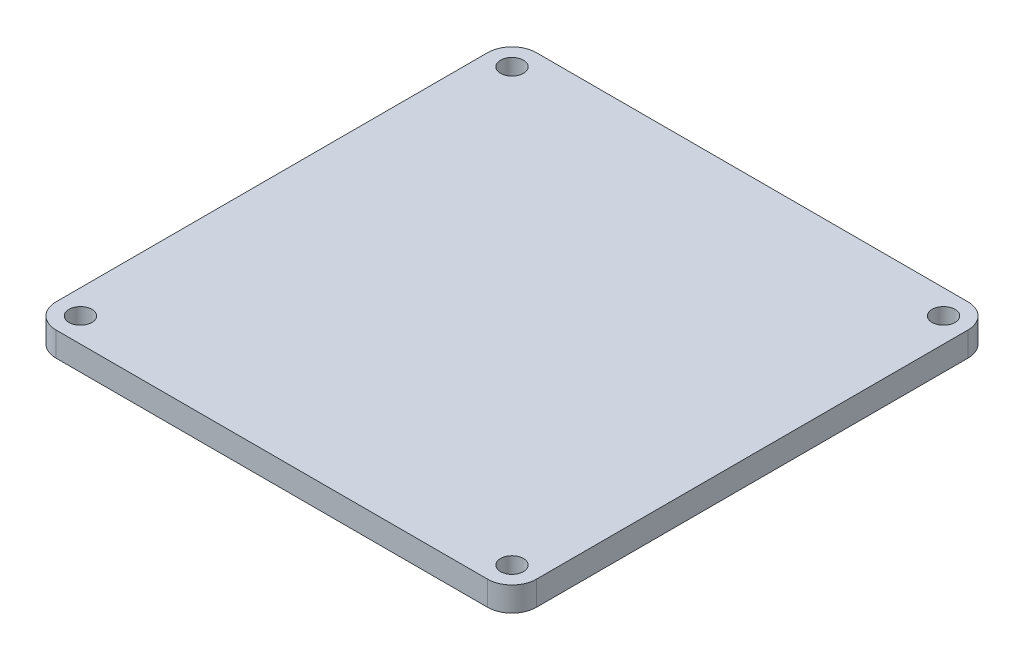
ISO-10303-21;
HEADER;
FILE_DESCRIPTION(('STEP AP214'),'2;1');
FILE_NAME('part.step','',(''),(''),'','','');
FILE_SCHEMA(('AUTOMOTIVE_DESIGN { 1 0 10303 214 1 1 1 1 }'));
ENDSEC;
DATA;
#1=APPLICATION_CONTEXT('core data for automotive mechanical design processes');
#2=APPLICATION_PROTOCOL_DEFINITION('international standard','automotive_design',2000,#1);
#3=PRODUCT_CONTEXT('',#1,'mechanical');
#4=PRODUCT('Part','Part','',(#3));
#5=PRODUCT_RELATED_PRODUCT_CATEGORY('part','',(#4));
#6=PRODUCT_DEFINITION_FORMATION('','',#4);
#7=PRODUCT_DEFINITION_CONTEXT('part definition',#1,'design');
#8=PRODUCT_DEFINITION('design','',#6,#7);
#9=PRODUCT_DEFINITION_SHAPE('','',#8);
#10=(LENGTH_UNIT() NAMED_UNIT(*) SI_UNIT(.MILLI.,.METRE.));
#11=(NAMED_UNIT(*) PLANE_ANGLE_UNIT() SI_UNIT($,.RADIAN.));
#12=(NAMED_UNIT(*) SI_UNIT($,.STERADIAN.) SOLID_ANGLE_UNIT());
#13=UNCERTAINTY_MEASURE_WITH_UNIT(LENGTH_MEASURE(1.E-05),#10,'distance_accuracy_value','');
#14=(GEOMETRIC_REPRESENTATION_CONTEXT(3) GLOBAL_UNCERTAINTY_ASSIGNED_CONTEXT((#13)) GLOBAL_UNIT_ASSIGNED_CONTEXT((#10,
#11,#12)) REPRESENTATION_CONTEXT('',''));
#15=CARTESIAN_POINT('',(0.,0.,0.));
#16=DIRECTION('',(0.,0.,1.));
#17=DIRECTION('',(1.,0.,0.));
#18=AXIS2_PLACEMENT_3D('',#15,#16,#17);
#19=CARTESIAN_POINT('',(89.8025612106915,-5.08,-89.8025612106915));
#20=DIRECTION('',(0.,1.,0.));
#21=DIRECTION('',(0.,0.,1.));
#22=AXIS2_PLACEMENT_3D('',#19,#20,#21);
#23=CYLINDRICAL_SURFACE('',#22,10.16);
#24=DIRECTION('',(0.,1.,0.));
#25=VECTOR('',#24,1.);
#26=CARTESIAN_POINT('',(89.8025612106915,-5.08,-99.9625612106915));
#27=LINE('',#26,#25);
#28=CARTESIAN_POINT('',(89.8025612106915,-5.08,-99.9625612106915));
#29=VERTEX_POINT('',#28);
#30=CARTESIAN_POINT('',(89.8025612106915,5.08,-99.9625612106915));
#31=VERTEX_POINT('',#30);
#32=EDGE_CURVE('E39',#29,#31,#27,.T.);
#33=ORIENTED_EDGE('',*,*,#32,.T.);
#34=CARTESIAN_POINT('',(89.8025612106915,5.08,-89.8025612106915));
#35=DIRECTION('',(0.,1.,0.));
#36=DIRECTION('',(0.,0.,1.));
#37=AXIS2_PLACEMENT_3D('',#34,#35,#36);
#38=CIRCLE('',#37,10.16);
#39=CARTESIAN_POINT('',(99.9625612106915,5.08,-89.8025612106915));
#40=VERTEX_POINT('',#39);
#41=EDGE_CURVE('E100',#40,#31,#38,.T.);
#42=ORIENTED_EDGE('',*,*,#41,.F.);
#43=DIRECTION('',(0.,1.,0.));
#44=VECTOR('',#43,1.);
#45=CARTESIAN_POINT('',(99.9625612106915,-5.08,-89.8025612106915));
#46=LINE('',#45,#44);
#47=CARTESIAN_POINT('',(99.9625612106915,-5.08,-89.8025612106915));
#48=VERTEX_POINT('',#47);
#49=EDGE_CURVE('E11',#48,#40,#46,.T.);
#50=ORIENTED_EDGE('',*,*,#49,.F.);
#51=CARTESIAN_POINT('',(89.8025612106915,-5.08,-89.8025612106915));
#52=DIRECTION('',(0.,1.,0.));
#53=DIRECTION('',(0.,0.,1.));
#54=AXIS2_PLACEMENT_3D('',#51,#52,#53);
#55=CIRCLE('',#54,10.16);
#56=EDGE_CURVE('E101',#48,#29,#55,.T.);
#57=ORIENTED_EDGE('',*,*,#56,.T.);
#58=EDGE_LOOP('',(#33,#42,#50,#57));
#59=FACE_BOUND('',#58,.T.);
#60=ADVANCED_FACE('F36',(#59),#23,.T.);
#61=CARTESIAN_POINT('',(99.9625612106915,-5.08,-89.8025612106915));
#62=DIRECTION('',(1.,0.,0.));
#63=DIRECTION('',(0.,0.,-1.));
#64=AXIS2_PLACEMENT_3D('',#61,#62,#63);
#65=PLANE('',#64);
#66=ORIENTED_EDGE('',*,*,#49,.T.);
#67=DIRECTION('',(0.,0.,-1.));
#68=VECTOR('',#67,1.);
#69=CARTESIAN_POINT('',(99.9625612106915,5.08,-89.8025612106915));
#70=LINE('',#69,#68);
#71=CARTESIAN_POINT('',(99.9625612106912,5.08,89.8025612106919));
#72=VERTEX_POINT('',#71);
#73=EDGE_CURVE('E119',#72,#40,#70,.T.);
#74=ORIENTED_EDGE('',*,*,#73,.F.);
#75=DIRECTION('',(0.,1.,0.));
#76=VECTOR('',#75,1.);
#77=CARTESIAN_POINT('',(99.9625612106912,-5.08,89.8025612106919));
#78=LINE('',#77,#76);
#79=CARTESIAN_POINT('',(99.9625612106912,-5.08,89.8025612106919));
#80=VERTEX_POINT('',#79);
#81=EDGE_CURVE('E44',#80,#72,#78,.T.);
#82=ORIENTED_EDGE('',*,*,#81,.F.);
#83=DIRECTION('',(0.,0.,-1.));
#84=VECTOR('',#83,1.);
#85=CARTESIAN_POINT('',(99.9625612106915,-5.08,-89.8025612106915));
#86=LINE('',#85,#84);
#87=EDGE_CURVE('E106',#80,#48,#86,.T.);
#88=ORIENTED_EDGE('',*,*,#87,.T.);
#89=EDGE_LOOP('',(#66,#74,#82,#88));
#90=FACE_BOUND('',#89,.T.);
#91=ADVANCED_FACE('F200',(#90),#65,.T.);
#92=CARTESIAN_POINT('',(89.8025612106912,-5.08,89.8025612106919));
#93=DIRECTION('',(0.,1.,0.));
#94=DIRECTION('',(0.,0.,1.));
#95=AXIS2_PLACEMENT_3D('',#92,#93,#94);
#96=CYLINDRICAL_SURFACE('',#95,10.16);
#97=ORIENTED_EDGE('',*,*,#81,.T.);
#98=CARTESIAN_POINT('',(89.8025612106912,5.08,89.8025612106919));
#99=DIRECTION('',(0.,1.,0.));
#100=DIRECTION('',(0.,0.,1.));
#101=AXIS2_PLACEMENT_3D('',#98,#99,#100);
#102=CIRCLE('',#101,10.16);
#103=CARTESIAN_POINT('',(89.8025612106912,5.08,99.9625612106919));
#104=VERTEX_POINT('',#103);
#105=EDGE_CURVE('E137',#104,#72,#102,.T.);
#106=ORIENTED_EDGE('',*,*,#105,.F.);
#107=DIRECTION('',(0.,1.,0.));
#108=VECTOR('',#107,1.);
#109=CARTESIAN_POINT('',(89.8025612106912,-5.08,99.9625612106919));
#110=LINE('',#109,#108);
#111=CARTESIAN_POINT('',(89.8025612106912,-5.08,99.9625612106919));
#112=VERTEX_POINT('',#111);
#113=EDGE_CURVE('E171',#112,#104,#110,.T.);
#114=ORIENTED_EDGE('',*,*,#113,.F.);
#115=CARTESIAN_POINT('',(89.8025612106912,-5.08,89.8025612106919));
#116=DIRECTION('',(0.,1.,0.));
#117=DIRECTION('',(0.,0.,1.));
#118=AXIS2_PLACEMENT_3D('',#115,#116,#117);
#119=CIRCLE('',#118,10.16);
#120=EDGE_CURVE('E167',#112,#80,#119,.T.);
#121=ORIENTED_EDGE('',*,*,#120,.T.);
#122=EDGE_LOOP('',(#97,#106,#114,#121));
#123=FACE_BOUND('',#122,.T.);
#124=ADVANCED_FACE('F199',(#123),#96,.T.);
#125=CARTESIAN_POINT('',(-89.8025612106922,-5.08,99.9625612106909));
#126=DIRECTION('',(0.,0.,1.));
#127=DIRECTION('',(1.,0.,0.));
#128=AXIS2_PLACEMENT_3D('',#125,#126,#127);
#129=PLANE('',#128);
#130=ORIENTED_EDGE('',*,*,#113,.T.);
#131=DIRECTION('',(1.,0.,0.));
#132=VECTOR('',#131,1.);
#133=CARTESIAN_POINT('',(-89.8025612106922,5.08,99.9625612106909));
#134=LINE('',#133,#132);
#135=CARTESIAN_POINT('',(-89.8025612106922,5.08,99.9625612106909));
#136=VERTEX_POINT('',#135);
#137=EDGE_CURVE('E134',#136,#104,#134,.T.);
#138=ORIENTED_EDGE('',*,*,#137,.F.);
#139=DIRECTION('',(0.,1.,0.));
#140=VECTOR('',#139,1.);
#141=CARTESIAN_POINT('',(-89.8025612106922,-5.08,99.9625612106909));
#142=LINE('',#141,#140);
#143=CARTESIAN_POINT('',(-89.8025612106922,-5.08,99.9625612106909));
#144=VERTEX_POINT('',#143);
#145=EDGE_CURVE('E173',#144,#136,#142,.T.);
#146=ORIENTED_EDGE('',*,*,#145,.F.);
#147=DIRECTION('',(1.,0.,0.));
#148=VECTOR('',#147,1.);
#149=CARTESIAN_POINT('',(-89.8025612106922,-5.08,99.9625612106909));
#150=LINE('',#149,#148);
#151=EDGE_CURVE('E164',#144,#112,#150,.T.);
#152=ORIENTED_EDGE('',*,*,#151,.T.);
#153=EDGE_LOOP('',(#130,#138,#146,#152));
#154=FACE_BOUND('',#153,.T.);
#155=ADVANCED_FACE('F195',(#154),#129,.T.);
#156=CARTESIAN_POINT('',(-89.8025612106922,-5.08,89.8025612106909));
#157=DIRECTION('',(0.,1.,0.));
#158=DIRECTION('',(0.,0.,1.));
#159=AXIS2_PLACEMENT_3D('',#156,#157,#158);
#160=CYLINDRICAL_SURFACE('',#159,10.16);
#161=ORIENTED_EDGE('',*,*,#145,.T.);
#162=CARTESIAN_POINT('',(-89.8025612106922,5.08,89.8025612106909));
#163=DIRECTION('',(0.,1.,0.));
#164=DIRECTION('',(0.,0.,1.));
#165=AXIS2_PLACEMENT_3D('',#162,#163,#164);
#166=CIRCLE('',#165,10.16);
#167=CARTESIAN_POINT('',(-99.9625612106922,5.08,89.8025612106909));
#168=VERTEX_POINT('',#167);
#169=EDGE_CURVE('E131',#168,#136,#166,.T.);
#170=ORIENTED_EDGE('',*,*,#169,.F.);
#171=DIRECTION('',(0.,1.,0.));
#172=VECTOR('',#171,1.);
#173=CARTESIAN_POINT('',(-99.9625612106922,-5.08,89.8025612106909));
#174=LINE('',#173,#172);
#175=CARTESIAN_POINT('',(-99.9625612106922,-5.08,89.8025612106909));
#176=VERTEX_POINT('',#175);
#177=EDGE_CURVE('E175',#176,#168,#174,.T.);
#178=ORIENTED_EDGE('',*,*,#177,.F.);
#179=CARTESIAN_POINT('',(-89.8025612106922,-5.08,89.8025612106909));
#180=DIRECTION('',(0.,1.,0.));
#181=DIRECTION('',(0.,0.,1.));
#182=AXIS2_PLACEMENT_3D('',#179,#180,#181);
#183=CIRCLE('',#182,10.16);
#184=EDGE_CURVE('E161',#176,#144,#183,.T.);
#185=ORIENTED_EDGE('',*,*,#184,.T.);
#186=EDGE_LOOP('',(#161,#170,#178,#185));
#187=FACE_BOUND('',#186,.T.);
#188=ADVANCED_FACE('F188',(#187),#160,.T.);
#189=CARTESIAN_POINT('',(-99.9625612106906,-5.08,-89.8025612106926));
#190=DIRECTION('',(-1.,0.,0.));
#191=DIRECTION('',(0.,0.,1.));
#192=AXIS2_PLACEMENT_3D('',#189,#190,#191);
#193=PLANE('',#192);
#194=ORIENTED_EDGE('',*,*,#177,.T.);
#195=DIRECTION('',(0.,0.,1.));
#196=VECTOR('',#195,1.);
#197=CARTESIAN_POINT('',(-99.9625612106906,5.08,-89.8025612106926));
#198=LINE('',#197,#196);
#199=CARTESIAN_POINT('',(-99.9625612106906,5.08,-89.8025612106926));
#200=VERTEX_POINT('',#199);
#201=EDGE_CURVE('E128',#200,#168,#198,.T.);
#202=ORIENTED_EDGE('',*,*,#201,.F.);
#203=DIRECTION('',(0.,1.,0.));
#204=VECTOR('',#203,1.);
#205=CARTESIAN_POINT('',(-99.9625612106906,-5.08,-89.8025612106926));
#206=LINE('',#205,#204);
#207=CARTESIAN_POINT('',(-99.9625612106906,-5.08,-89.8025612106926));
#208=VERTEX_POINT('',#207);
#209=EDGE_CURVE('E177',#208,#200,#206,.T.);
#210=ORIENTED_EDGE('',*,*,#209,.F.);
#211=DIRECTION('',(0.,0.,1.));
#212=VECTOR('',#211,1.);
#213=CARTESIAN_POINT('',(-99.9625612106906,-5.08,-89.8025612106926));
#214=LINE('',#213,#212);
#215=EDGE_CURVE('E158',#208,#176,#214,.T.);
#216=ORIENTED_EDGE('',*,*,#215,.T.);
#217=EDGE_LOOP('',(#194,#202,#210,#216));
#218=FACE_BOUND('',#217,.T.);
#219=ADVANCED_FACE('F185',(#218),#193,.T.);
#220=CARTESIAN_POINT('',(-89.8025612106915,-5.08,-89.8025612106915));
#221=DIRECTION('',(0.,1.,0.));
#222=DIRECTION('',(0.,0.,1.));
#223=AXIS2_PLACEMENT_3D('',#220,#221,#222);
#224=CYLINDRICAL_SURFACE('',#223,10.16);
#225=ORIENTED_EDGE('',*,*,#209,.T.);
#226=CARTESIAN_POINT('',(-89.8025612106915,5.08,-89.8025612106915));
#227=DIRECTION('',(0.,1.,0.));
#228=DIRECTION('',(0.,0.,1.));
#229=AXIS2_PLACEMENT_3D('',#226,#227,#228);
#230=CIRCLE('',#229,10.16);
#231=CARTESIAN_POINT('',(-89.8025612106905,5.08,-99.9625612106915));
#232=VERTEX_POINT('',#231);
#233=EDGE_CURVE('E113',#232,#200,#230,.T.);
#234=ORIENTED_EDGE('',*,*,#233,.F.);
#235=DIRECTION('',(0.,1.,0.));
#236=VECTOR('',#235,1.);
#237=CARTESIAN_POINT('',(-89.8025612106905,-5.08,-99.9625612106915));
#238=LINE('',#237,#236);
#239=CARTESIAN_POINT('',(-89.8025612106905,-5.08,-99.9625612106915));
#240=VERTEX_POINT('',#239);
#241=EDGE_CURVE('E105',#240,#232,#238,.T.);
#242=ORIENTED_EDGE('',*,*,#241,.F.);
#243=CARTESIAN_POINT('',(-89.8025612106915,-5.08,-89.8025612106915));
#244=DIRECTION('',(0.,1.,0.));
#245=DIRECTION('',(0.,0.,1.));
#246=AXIS2_PLACEMENT_3D('',#243,#244,#245);
#247=CIRCLE('',#246,10.16);
#248=EDGE_CURVE('E155',#240,#208,#247,.T.);
#249=ORIENTED_EDGE('',*,*,#248,.T.);
#250=EDGE_LOOP('',(#225,#234,#242,#249));
#251=FACE_BOUND('',#250,.T.);
#252=ADVANCED_FACE('F179',(#251),#224,.T.);
#253=CARTESIAN_POINT('',(-89.8025612106905,-5.08,-99.9625612106925));
#254=DIRECTION('',(0.,0.,-1.));
#255=DIRECTION('',(-1.,0.,0.));
#256=AXIS2_PLACEMENT_3D('',#253,#254,#255);
#257=PLANE('',#256);
#258=ORIENTED_EDGE('',*,*,#241,.T.);
#259=DIRECTION('',(-1.,0.,0.));
#260=VECTOR('',#259,1.);
#261=CARTESIAN_POINT('',(-89.8025612106905,5.08,-99.9625612106925));
#262=LINE('',#261,#260);
#263=EDGE_CURVE('E108',#31,#232,#262,.T.);
#264=ORIENTED_EDGE('',*,*,#263,.F.);
#265=ORIENTED_EDGE('',*,*,#32,.F.);
#266=DIRECTION('',(-1.,0.,0.));
#267=VECTOR('',#266,1.);
#268=CARTESIAN_POINT('',(-89.8025612106905,-5.08,-99.9625612106925));
#269=LINE('',#268,#267);
#270=EDGE_CURVE('E153',#29,#240,#269,.T.);
#271=ORIENTED_EDGE('',*,*,#270,.T.);
#272=EDGE_LOOP('',(#258,#264,#265,#271));
#273=FACE_BOUND('',#272,.T.);
#274=ADVANCED_FACE('F109',(#273),#257,.T.);
#275=CARTESIAN_POINT('',(89.8025612106915,-5.08,-89.8025612106915));
#276=DIRECTION('',(0.,1.,0.));
#277=DIRECTION('',(0.,0.,1.));
#278=AXIS2_PLACEMENT_3D('',#275,#276,#277);
#279=PLANE('',#278);
#280=CARTESIAN_POINT('',(-89.8025612106915,-5.08,-89.8025612106915));
#281=DIRECTION('',(0.,1.,0.));
#282=DIRECTION('',(0.,0.,1.));
#283=AXIS2_PLACEMENT_3D('',#280,#281,#282);
#284=CIRCLE('',#283,4.7625);
#285=CARTESIAN_POINT('',(-89.8025612106915,-5.08,-85.0400612106915));
#286=VERTEX_POINT('',#285);
#287=EDGE_CURVE('E140',#286,#286,#284,.T.);
#288=ORIENTED_EDGE('',*,*,#287,.T.);
#289=EDGE_LOOP('',(#288));
#290=FACE_BOUND('',#289,.T.);
#291=CARTESIAN_POINT('',(-89.8025612106922,-5.08,89.8025612106909));
#292=DIRECTION('',(0.,1.,0.));
#293=DIRECTION('',(0.,0.,1.));
#294=AXIS2_PLACEMENT_3D('',#291,#292,#293);
#295=CIRCLE('',#294,4.7625);
#296=CARTESIAN_POINT('',(-89.8025612106922,-5.08,94.5650612106909));
#297=VERTEX_POINT('',#296);
#298=EDGE_CURVE('E143',#297,#297,#295,.T.);
#299=ORIENTED_EDGE('',*,*,#298,.T.);
#300=EDGE_LOOP('',(#299));
#301=FACE_BOUND('',#300,.T.);
#302=CARTESIAN_POINT('',(89.8025612106912,-5.08,89.8025612106919));
#303=DIRECTION('',(0.,1.,0.));
#304=DIRECTION('',(0.,0.,1.));
#305=AXIS2_PLACEMENT_3D('',#302,#303,#304);
#306=CIRCLE('',#305,4.7625);
#307=CARTESIAN_POINT('',(89.8025612106912,-5.08,94.5650612106919));
#308=VERTEX_POINT('',#307);
#309=EDGE_CURVE('E146',#308,#308,#306,.T.);
#310=ORIENTED_EDGE('',*,*,#309,.T.);
#311=EDGE_LOOP('',(#310));
#312=FACE_BOUND('',#311,.T.);
#313=CARTESIAN_POINT('',(89.8025612106915,-5.08,-89.8025612106915));
#314=DIRECTION('',(0.,1.,0.));
#315=DIRECTION('',(0.,0.,1.));
#316=AXIS2_PLACEMENT_3D('',#313,#314,#315);
#317=CIRCLE('',#316,4.7625);
#318=CARTESIAN_POINT('',(89.8025612106915,-5.08,-85.0400612106915));
#319=VERTEX_POINT('',#318);
#320=EDGE_CURVE('E149',#319,#319,#317,.T.);
#321=ORIENTED_EDGE('',*,*,#320,.T.);
#322=EDGE_LOOP('',(#321));
#323=FACE_BOUND('',#322,.T.);
#324=ORIENTED_EDGE('',*,*,#56,.F.);
#325=ORIENTED_EDGE('',*,*,#87,.F.);
#326=ORIENTED_EDGE('',*,*,#120,.F.);
#327=ORIENTED_EDGE('',*,*,#151,.F.);
#328=ORIENTED_EDGE('',*,*,#184,.F.);
#329=ORIENTED_EDGE('',*,*,#215,.F.);
#330=ORIENTED_EDGE('',*,*,#248,.F.);
#331=ORIENTED_EDGE('',*,*,#270,.F.);
#332=EDGE_LOOP('',(#324,#325,#326,#327,#328,#329,#330,#331));
#333=FACE_BOUND('',#332,.T.);
#334=ADVANCED_FACE('F191',(#290,#301,#312,#323,#333),#279,.F.);
#335=CARTESIAN_POINT('',(89.8025612106915,-5.08,-89.8025612106915));
#336=DIRECTION('',(0.,1.,0.));
#337=DIRECTION('',(0.,0.,1.));
#338=AXIS2_PLACEMENT_3D('',#335,#336,#337);
#339=CYLINDRICAL_SURFACE('',#338,4.7625);
#340=ORIENTED_EDGE('',*,*,#320,.F.);
#341=EDGE_LOOP('',(#340));
#342=FACE_BOUND('',#341,.T.);
#343=CARTESIAN_POINT('',(89.8025612106915,5.08,-89.8025612106915));
#344=DIRECTION('',(0.,1.,0.));
#345=DIRECTION('',(0.,0.,1.));
#346=AXIS2_PLACEMENT_3D('',#343,#344,#345);
#347=CIRCLE('',#346,4.7625);
#348=CARTESIAN_POINT('',(89.8025612106915,5.08,-85.0400612106915));
#349=VERTEX_POINT('',#348);
#350=EDGE_CURVE('E120',#349,#349,#347,.T.);
#351=ORIENTED_EDGE('',*,*,#350,.T.);
#352=EDGE_LOOP('',(#351));
#353=FACE_BOUND('',#352,.T.);
#354=ADVANCED_FACE('F222',(#342,#353),#339,.F.);
#355=CARTESIAN_POINT('',(89.8025612106912,-5.08,89.8025612106919));
#356=DIRECTION('',(0.,1.,0.));
#357=DIRECTION('',(0.,0.,1.));
#358=AXIS2_PLACEMENT_3D('',#355,#356,#357);
#359=CYLINDRICAL_SURFACE('',#358,4.7625);
#360=ORIENTED_EDGE('',*,*,#309,.F.);
#361=EDGE_LOOP('',(#360));
#362=FACE_BOUND('',#361,.T.);
#363=CARTESIAN_POINT('',(89.8025612106912,5.08,89.8025612106919));
#364=DIRECTION('',(0.,1.,0.));
#365=DIRECTION('',(0.,0.,1.));
#366=AXIS2_PLACEMENT_3D('',#363,#364,#365);
#367=CIRCLE('',#366,4.7625);
#368=CARTESIAN_POINT('',(89.8025612106912,5.08,94.5650612106919));
#369=VERTEX_POINT('',#368);
#370=EDGE_CURVE('E123',#369,#369,#367,.T.);
#371=ORIENTED_EDGE('',*,*,#370,.T.);
#372=EDGE_LOOP('',(#371));
#373=FACE_BOUND('',#372,.T.);
#374=ADVANCED_FACE('F227',(#362,#373),#359,.F.);
#375=CARTESIAN_POINT('',(-89.8025612106922,-5.08,89.8025612106909));
#376=DIRECTION('',(0.,1.,0.));
#377=DIRECTION('',(0.,0.,1.));
#378=AXIS2_PLACEMENT_3D('',#375,#376,#377);
#379=CYLINDRICAL_SURFACE('',#378,4.7625);
#380=ORIENTED_EDGE('',*,*,#298,.F.);
#381=EDGE_LOOP('',(#380));
#382=FACE_BOUND('',#381,.T.);
#383=CARTESIAN_POINT('',(-89.8025612106922,5.08,89.8025612106909));
#384=DIRECTION('',(0.,1.,0.));
#385=DIRECTION('',(0.,0.,1.));
#386=AXIS2_PLACEMENT_3D('',#383,#384,#385);
#387=CIRCLE('',#386,4.7625);
#388=CARTESIAN_POINT('',(-89.8025612106922,5.08,94.5650612106909));
#389=VERTEX_POINT('',#388);
#390=EDGE_CURVE('E261',#389,#389,#387,.T.);
#391=ORIENTED_EDGE('',*,*,#390,.T.);
#392=EDGE_LOOP('',(#391));
#393=FACE_BOUND('',#392,.T.);
#394=ADVANCED_FACE('F246',(#382,#393),#379,.F.);
#395=CARTESIAN_POINT('',(-89.8025612106915,-5.08,-89.8025612106915));
#396=DIRECTION('',(0.,1.,0.));
#397=DIRECTION('',(0.,0.,1.));
#398=AXIS2_PLACEMENT_3D('',#395,#396,#397);
#399=CYLINDRICAL_SURFACE('',#398,4.7625);
#400=ORIENTED_EDGE('',*,*,#287,.F.);
#401=EDGE_LOOP('',(#400));
#402=FACE_BOUND('',#401,.T.);
#403=CARTESIAN_POINT('',(-89.8025612106915,5.08,-89.8025612106915));
#404=DIRECTION('',(0.,1.,0.));
#405=DIRECTION('',(0.,0.,1.));
#406=AXIS2_PLACEMENT_3D('',#403,#404,#405);
#407=CIRCLE('',#406,4.7625);
#408=CARTESIAN_POINT('',(-89.8025612106915,5.08,-85.0400612106915));
#409=VERTEX_POINT('',#408);
#410=EDGE_CURVE('E263',#409,#409,#407,.T.);
#411=ORIENTED_EDGE('',*,*,#410,.T.);
#412=EDGE_LOOP('',(#411));
#413=FACE_BOUND('',#412,.T.);
#414=ADVANCED_FACE('F240',(#402,#413),#399,.F.);
#415=CARTESIAN_POINT('',(89.8025612106915,5.08,-89.8025612106915));
#416=DIRECTION('',(0.,1.,0.));
#417=DIRECTION('',(0.,0.,1.));
#418=AXIS2_PLACEMENT_3D('',#415,#416,#417);
#419=PLANE('',#418);
#420=ORIENTED_EDGE('',*,*,#390,.F.);
#421=EDGE_LOOP('',(#420));
#422=FACE_BOUND('',#421,.T.);
#423=ORIENTED_EDGE('',*,*,#350,.F.);
#424=EDGE_LOOP('',(#423));
#425=FACE_BOUND('',#424,.T.);
#426=ORIENTED_EDGE('',*,*,#41,.T.);
#427=ORIENTED_EDGE('',*,*,#263,.T.);
#428=ORIENTED_EDGE('',*,*,#233,.T.);
#429=ORIENTED_EDGE('',*,*,#201,.T.);
#430=ORIENTED_EDGE('',*,*,#169,.T.);
#431=ORIENTED_EDGE('',*,*,#137,.T.);
#432=ORIENTED_EDGE('',*,*,#105,.T.);
#433=ORIENTED_EDGE('',*,*,#73,.T.);
#434=EDGE_LOOP('',(#426,#427,#428,#429,#430,#431,#432,#433));
#435=FACE_BOUND('',#434,.T.);
#436=ORIENTED_EDGE('',*,*,#370,.F.);
#437=EDGE_LOOP('',(#436));
#438=FACE_BOUND('',#437,.T.);
#439=ORIENTED_EDGE('',*,*,#410,.F.);
#440=EDGE_LOOP('',(#439));
#441=FACE_BOUND('',#440,.T.);
#442=ADVANCED_FACE('F116',(#422,#425,#435,#438,#441),#419,.T.);
#443=CLOSED_SHELL('',(#60,#91,#124,#155,#188,#219,#252,#274,#334,#354,#374,#394,#414,#442));
#444=MANIFOLD_SOLID_BREP('B2',#443);
#445=ADVANCED_BREP_SHAPE_REPRESENTATION('',(#18,#444),#14);
#446=SHAPE_DEFINITION_REPRESENTATION(#9,#445);
ENDSEC;
END-ISO-10303-21;
